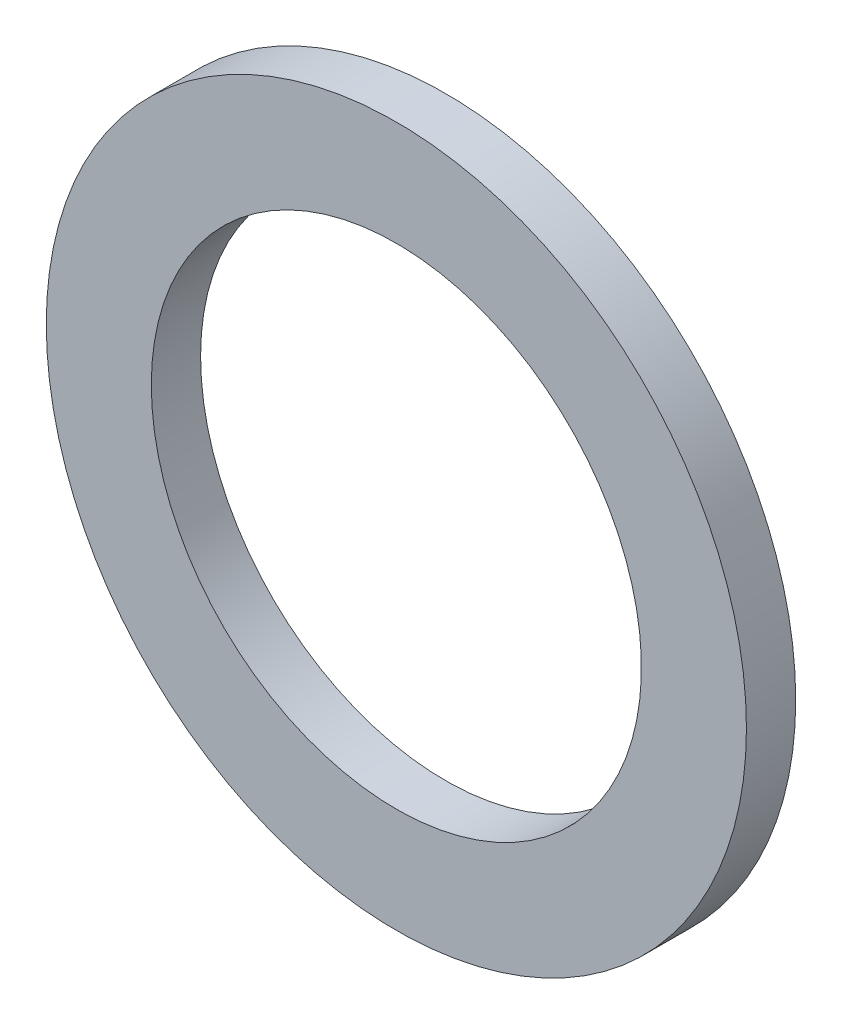
ISO-10303-21;
HEADER;
FILE_DESCRIPTION(('STEP AP214'),'2;1');
FILE_NAME('part.step','',(''),(''),'','','');
FILE_SCHEMA(('AUTOMOTIVE_DESIGN { 1 0 10303 214 1 1 1 1 }'));
ENDSEC;
DATA;
#1=APPLICATION_CONTEXT('core data for automotive mechanical design processes');
#2=APPLICATION_PROTOCOL_DEFINITION('international standard','automotive_design',2000,#1);
#3=PRODUCT_CONTEXT('',#1,'mechanical');
#4=PRODUCT('Part','Part','',(#3));
#5=PRODUCT_RELATED_PRODUCT_CATEGORY('part','',(#4));
#6=PRODUCT_DEFINITION_FORMATION('','',#4);
#7=PRODUCT_DEFINITION_CONTEXT('part definition',#1,'design');
#8=PRODUCT_DEFINITION('design','',#6,#7);
#9=PRODUCT_DEFINITION_SHAPE('','',#8);
#10=(LENGTH_UNIT() NAMED_UNIT(*) SI_UNIT(.MILLI.,.METRE.));
#11=(NAMED_UNIT(*) PLANE_ANGLE_UNIT() SI_UNIT($,.RADIAN.));
#12=(NAMED_UNIT(*) SI_UNIT($,.STERADIAN.) SOLID_ANGLE_UNIT());
#13=UNCERTAINTY_MEASURE_WITH_UNIT(LENGTH_MEASURE(1.E-05),#10,'distance_accuracy_value','');
#14=(GEOMETRIC_REPRESENTATION_CONTEXT(3) GLOBAL_UNCERTAINTY_ASSIGNED_CONTEXT((#13)) GLOBAL_UNIT_ASSIGNED_CONTEXT((#10,
#11,#12)) REPRESENTATION_CONTEXT('',''));
#15=CARTESIAN_POINT('',(0.,0.,0.));
#16=DIRECTION('',(0.,0.,1.));
#17=DIRECTION('',(1.,0.,0.));
#18=AXIS2_PLACEMENT_3D('',#15,#16,#17);
#19=CARTESIAN_POINT('',(0.,0.,0.5588));
#20=DIRECTION('',(0.,0.,-1.));
#21=DIRECTION('',(1.,0.,0.));
#22=AXIS2_PLACEMENT_3D('',#19,#20,#21);
#23=PLANE('',#22);
#24=CARTESIAN_POINT('',(0.,0.,0.5588));
#25=DIRECTION('',(0.,0.,-1.));
#26=DIRECTION('',(-1.,0.,0.));
#27=AXIS2_PLACEMENT_3D('',#24,#25,#26);
#28=CIRCLE('',#27,5.55625);
#29=CARTESIAN_POINT('',(-5.55625,0.,0.5588));
#30=VERTEX_POINT('',#29);
#31=EDGE_CURVE('E47',#30,#30,#28,.F.);
#32=ORIENTED_EDGE('',*,*,#31,.F.);
#33=EDGE_LOOP('',(#32));
#34=FACE_BOUND('',#33,.T.);
#35=CARTESIAN_POINT('',(0.,0.,0.5588));
#36=DIRECTION('',(0.,0.,-1.));
#37=DIRECTION('',(-1.,0.,0.));
#38=AXIS2_PLACEMENT_3D('',#35,#36,#37);
#39=CIRCLE('',#38,7.9375);
#40=CARTESIAN_POINT('',(-7.9375,0.,0.5588));
#41=VERTEX_POINT('',#40);
#42=EDGE_CURVE('E38',#41,#41,#39,.F.);
#43=ORIENTED_EDGE('',*,*,#42,.T.);
#44=EDGE_LOOP('',(#43));
#45=FACE_BOUND('',#44,.T.);
#46=ADVANCED_FACE('F35',(#34,#45),#23,.F.);
#47=CARTESIAN_POINT('',(0.,0.,-0.5588));
#48=DIRECTION('',(0.,0.,1.));
#49=DIRECTION('',(-1.,0.,0.));
#50=AXIS2_PLACEMENT_3D('',#47,#48,#49);
#51=CYLINDRICAL_SURFACE('',#50,7.9375);
#52=ORIENTED_EDGE('',*,*,#42,.F.);
#53=EDGE_LOOP('',(#52));
#54=FACE_BOUND('',#53,.T.);
#55=CARTESIAN_POINT('',(0.,0.,-0.5588));
#56=DIRECTION('',(0.,0.,-1.));
#57=DIRECTION('',(-1.,0.,0.));
#58=AXIS2_PLACEMENT_3D('',#55,#56,#57);
#59=CIRCLE('',#58,7.9375);
#60=CARTESIAN_POINT('',(-7.9375,0.,-0.5588));
#61=VERTEX_POINT('',#60);
#62=EDGE_CURVE('E42',#61,#61,#59,.F.);
#63=ORIENTED_EDGE('',*,*,#62,.T.);
#64=EDGE_LOOP('',(#63));
#65=FACE_BOUND('',#64,.T.);
#66=ADVANCED_FACE('F56',(#54,#65),#51,.T.);
#67=CARTESIAN_POINT('',(0.,0.,-0.5588));
#68=DIRECTION('',(0.,0.,1.));
#69=DIRECTION('',(-1.,0.,0.));
#70=AXIS2_PLACEMENT_3D('',#67,#68,#69);
#71=CYLINDRICAL_SURFACE('',#70,5.55625);
#72=CARTESIAN_POINT('',(0.,0.,-0.5588));
#73=DIRECTION('',(0.,0.,-1.));
#74=DIRECTION('',(-1.,0.,0.));
#75=AXIS2_PLACEMENT_3D('',#72,#73,#74);
#76=CIRCLE('',#75,5.55625);
#77=CARTESIAN_POINT('',(-5.55625,0.,-0.5588));
#78=VERTEX_POINT('',#77);
#79=EDGE_CURVE('E10',#78,#78,#76,.T.);
#80=ORIENTED_EDGE('',*,*,#79,.T.);
#81=EDGE_LOOP('',(#80));
#82=FACE_BOUND('',#81,.T.);
#83=ORIENTED_EDGE('',*,*,#31,.T.);
#84=EDGE_LOOP('',(#83));
#85=FACE_BOUND('',#84,.T.);
#86=ADVANCED_FACE('F59',(#82,#85),#71,.F.);
#87=CARTESIAN_POINT('',(0.,0.,-0.5588));
#88=DIRECTION('',(0.,0.,-1.));
#89=DIRECTION('',(1.,0.,0.));
#90=AXIS2_PLACEMENT_3D('',#87,#88,#89);
#91=PLANE('',#90);
#92=ORIENTED_EDGE('',*,*,#79,.F.);
#93=EDGE_LOOP('',(#92));
#94=FACE_BOUND('',#93,.T.);
#95=ORIENTED_EDGE('',*,*,#62,.F.);
#96=EDGE_LOOP('',(#95));
#97=FACE_BOUND('',#96,.T.);
#98=ADVANCED_FACE('F62',(#94,#97),#91,.T.);
#99=CLOSED_SHELL('',(#46,#66,#86,#98));
#100=MANIFOLD_SOLID_BREP('B2',#99);
#101=ADVANCED_BREP_SHAPE_REPRESENTATION('',(#18,#100),#14);
#102=SHAPE_DEFINITION_REPRESENTATION(#9,#101);
ENDSEC;
END-ISO-10303-21;
